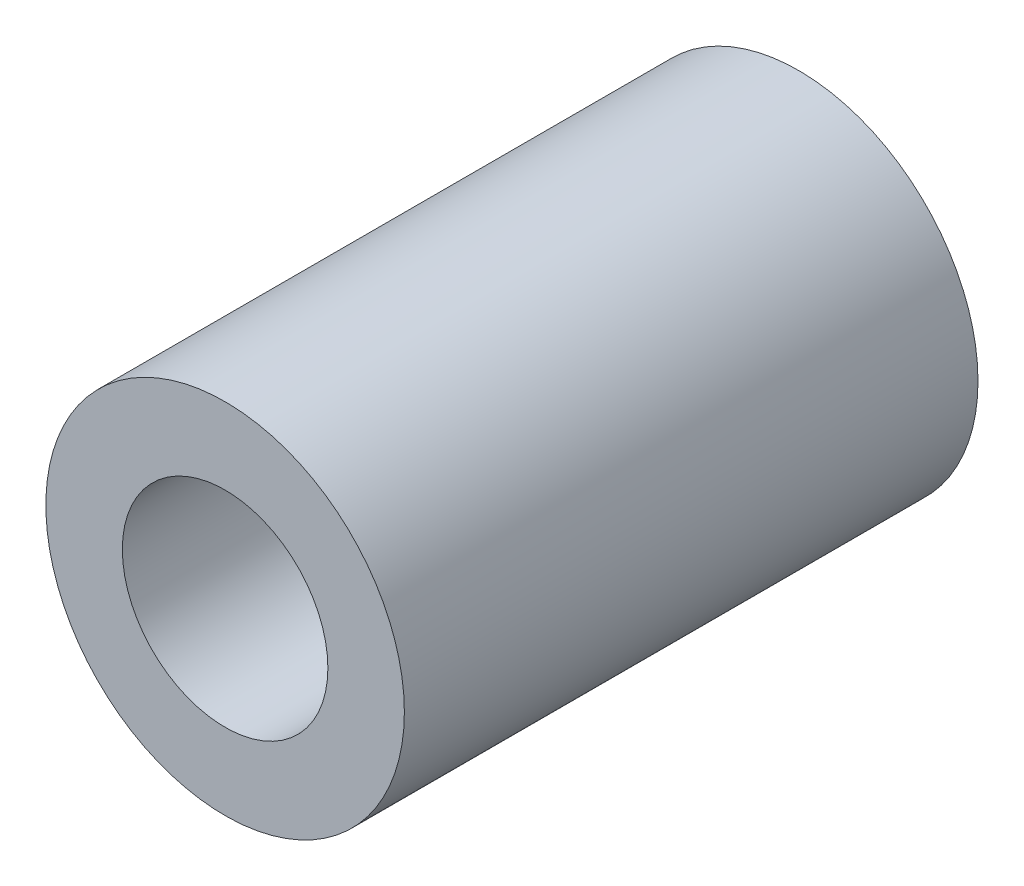
ISO-10303-21;
HEADER;
FILE_DESCRIPTION(('STEP AP214'),'2;1');
FILE_NAME('part.step','',(''),(''),'','','');
FILE_SCHEMA(('AUTOMOTIVE_DESIGN { 1 0 10303 214 1 1 1 1 }'));
ENDSEC;
DATA;
#1=APPLICATION_CONTEXT('core data for automotive mechanical design processes');
#2=APPLICATION_PROTOCOL_DEFINITION('international standard','automotive_design',2000,#1);
#3=PRODUCT_CONTEXT('',#1,'mechanical');
#4=PRODUCT('Part','Part','',(#3));
#5=PRODUCT_RELATED_PRODUCT_CATEGORY('part','',(#4));
#6=PRODUCT_DEFINITION_FORMATION('','',#4);
#7=PRODUCT_DEFINITION_CONTEXT('part definition',#1,'design');
#8=PRODUCT_DEFINITION('design','',#6,#7);
#9=PRODUCT_DEFINITION_SHAPE('','',#8);
#10=(LENGTH_UNIT() NAMED_UNIT(*) SI_UNIT(.MILLI.,.METRE.));
#11=(NAMED_UNIT(*) PLANE_ANGLE_UNIT() SI_UNIT($,.RADIAN.));
#12=(NAMED_UNIT(*) SI_UNIT($,.STERADIAN.) SOLID_ANGLE_UNIT());
#13=UNCERTAINTY_MEASURE_WITH_UNIT(LENGTH_MEASURE(1.E-05),#10,'distance_accuracy_value','');
#14=(GEOMETRIC_REPRESENTATION_CONTEXT(3) GLOBAL_UNCERTAINTY_ASSIGNED_CONTEXT((#13)) GLOBAL_UNIT_ASSIGNED_CONTEXT((#10,
#11,#12)) REPRESENTATION_CONTEXT('',''));
#15=CARTESIAN_POINT('',(0.,0.,0.));
#16=DIRECTION('',(0.,0.,1.));
#17=DIRECTION('',(1.,0.,0.));
#18=AXIS2_PLACEMENT_3D('',#15,#16,#17);
#19=CARTESIAN_POINT('',(0.,0.,24.));
#20=DIRECTION('',(0.,0.,1.));
#21=DIRECTION('',(1.,0.,0.));
#22=AXIS2_PLACEMENT_3D('',#19,#20,#21);
#23=PLANE('',#22);
#24=CARTESIAN_POINT('',(0.,0.,24.));
#25=DIRECTION('',(0.,0.,1.));
#26=DIRECTION('',(1.,0.,0.));
#27=AXIS2_PLACEMENT_3D('',#24,#25,#26);
#28=CIRCLE('',#27,7.5);
#29=CARTESIAN_POINT('',(7.5,0.,24.));
#30=VERTEX_POINT('',#29);
#31=EDGE_CURVE('E10',#30,#30,#28,.T.);
#32=ORIENTED_EDGE('',*,*,#31,.T.);
#33=EDGE_LOOP('',(#32));
#34=FACE_BOUND('',#33,.T.);
#35=CARTESIAN_POINT('',(0.,0.,24.));
#36=DIRECTION('',(0.,0.,1.));
#37=DIRECTION('',(1.,0.,0.));
#38=AXIS2_PLACEMENT_3D('',#35,#36,#37);
#39=CIRCLE('',#38,4.3);
#40=CARTESIAN_POINT('',(4.3,0.,24.));
#41=VERTEX_POINT('',#40);
#42=EDGE_CURVE('E42',#41,#41,#39,.T.);
#43=ORIENTED_EDGE('',*,*,#42,.F.);
#44=EDGE_LOOP('',(#43));
#45=FACE_BOUND('',#44,.T.);
#46=ADVANCED_FACE('F31',(#34,#45),#23,.T.);
#47=CARTESIAN_POINT('',(0.,0.,0.));
#48=DIRECTION('',(0.,0.,1.));
#49=DIRECTION('',(1.,0.,0.));
#50=AXIS2_PLACEMENT_3D('',#47,#48,#49);
#51=PLANE('',#50);
#52=CARTESIAN_POINT('',(0.,0.,0.));
#53=DIRECTION('',(0.,0.,1.));
#54=DIRECTION('',(1.,0.,0.));
#55=AXIS2_PLACEMENT_3D('',#52,#53,#54);
#56=CIRCLE('',#55,7.5);
#57=CARTESIAN_POINT('',(7.5,0.,0.));
#58=VERTEX_POINT('',#57);
#59=EDGE_CURVE('E35',#58,#58,#56,.T.);
#60=ORIENTED_EDGE('',*,*,#59,.F.);
#61=EDGE_LOOP('',(#60));
#62=FACE_BOUND('',#61,.T.);
#63=CARTESIAN_POINT('',(0.,0.,0.));
#64=DIRECTION('',(0.,0.,1.));
#65=DIRECTION('',(1.,0.,0.));
#66=AXIS2_PLACEMENT_3D('',#63,#64,#65);
#67=CIRCLE('',#66,4.3);
#68=CARTESIAN_POINT('',(4.3,0.,0.));
#69=VERTEX_POINT('',#68);
#70=EDGE_CURVE('E44',#69,#69,#67,.T.);
#71=ORIENTED_EDGE('',*,*,#70,.T.);
#72=EDGE_LOOP('',(#71));
#73=FACE_BOUND('',#72,.T.);
#74=ADVANCED_FACE('F54',(#62,#73),#51,.F.);
#75=CARTESIAN_POINT('',(0.,0.,24.));
#76=DIRECTION('',(0.,0.,-1.));
#77=DIRECTION('',(-1.,0.,0.));
#78=AXIS2_PLACEMENT_3D('',#75,#76,#77);
#79=CYLINDRICAL_SURFACE('',#78,7.5);
#80=ORIENTED_EDGE('',*,*,#31,.F.);
#81=EDGE_LOOP('',(#80));
#82=FACE_BOUND('',#81,.T.);
#83=ORIENTED_EDGE('',*,*,#59,.T.);
#84=EDGE_LOOP('',(#83));
#85=FACE_BOUND('',#84,.T.);
#86=ADVANCED_FACE('F33',(#82,#85),#79,.T.);
#87=CARTESIAN_POINT('',(0.,0.,24.));
#88=DIRECTION('',(0.,0.,-1.));
#89=DIRECTION('',(-1.,0.,0.));
#90=AXIS2_PLACEMENT_3D('',#87,#88,#89);
#91=CYLINDRICAL_SURFACE('',#90,4.3);
#92=ORIENTED_EDGE('',*,*,#42,.T.);
#93=EDGE_LOOP('',(#92));
#94=FACE_BOUND('',#93,.T.);
#95=ORIENTED_EDGE('',*,*,#70,.F.);
#96=EDGE_LOOP('',(#95));
#97=FACE_BOUND('',#96,.T.);
#98=ADVANCED_FACE('F50',(#94,#97),#91,.F.);
#99=CLOSED_SHELL('',(#46,#74,#86,#98));
#100=MANIFOLD_SOLID_BREP('B2',#99);
#101=ADVANCED_BREP_SHAPE_REPRESENTATION('',(#18,#100),#14);
#102=SHAPE_DEFINITION_REPRESENTATION(#9,#101);
ENDSEC;
END-ISO-10303-21;
